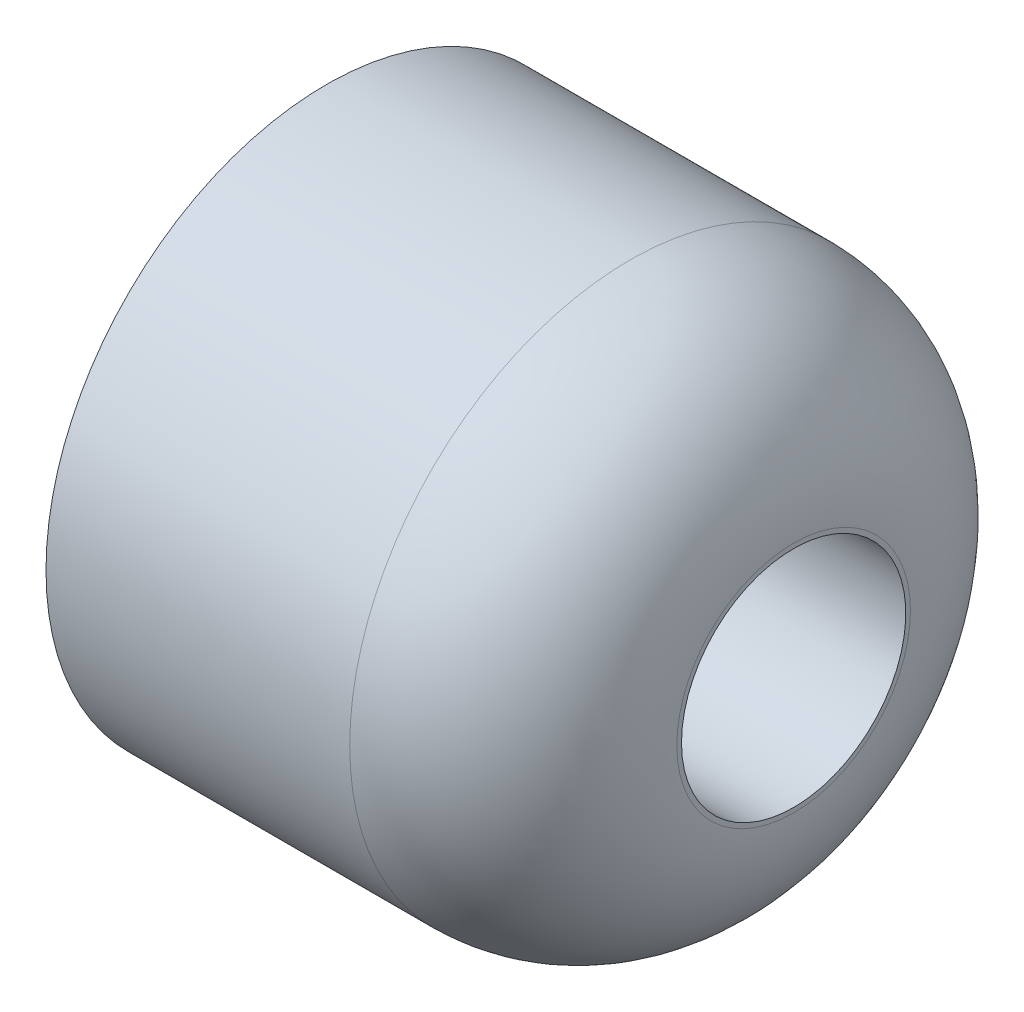
ISO-10303-21;
HEADER;
FILE_DESCRIPTION(('STEP AP214'),'2;1');
FILE_NAME('part.step','',(''),(''),'','','');
FILE_SCHEMA(('AUTOMOTIVE_DESIGN { 1 0 10303 214 1 1 1 1 }'));
ENDSEC;
DATA;
#1=APPLICATION_CONTEXT('core data for automotive mechanical design processes');
#2=APPLICATION_PROTOCOL_DEFINITION('international standard','automotive_design',2000,#1);
#3=PRODUCT_CONTEXT('',#1,'mechanical');
#4=PRODUCT('Part','Part','',(#3));
#5=PRODUCT_RELATED_PRODUCT_CATEGORY('part','',(#4));
#6=PRODUCT_DEFINITION_FORMATION('','',#4);
#7=PRODUCT_DEFINITION_CONTEXT('part definition',#1,'design');
#8=PRODUCT_DEFINITION('design','',#6,#7);
#9=PRODUCT_DEFINITION_SHAPE('','',#8);
#10=(LENGTH_UNIT() NAMED_UNIT(*) SI_UNIT(.MILLI.,.METRE.));
#11=(NAMED_UNIT(*) PLANE_ANGLE_UNIT() SI_UNIT($,.RADIAN.));
#12=(NAMED_UNIT(*) SI_UNIT($,.STERADIAN.) SOLID_ANGLE_UNIT());
#13=UNCERTAINTY_MEASURE_WITH_UNIT(LENGTH_MEASURE(1.E-05),#10,'distance_accuracy_value','');
#14=(GEOMETRIC_REPRESENTATION_CONTEXT(3) GLOBAL_UNCERTAINTY_ASSIGNED_CONTEXT((#13)) GLOBAL_UNIT_ASSIGNED_CONTEXT((#10,
#11,#12)) REPRESENTATION_CONTEXT('',''));
#15=CARTESIAN_POINT('',(0.,0.,0.));
#16=DIRECTION('',(0.,0.,1.));
#17=DIRECTION('',(1.,0.,0.));
#18=AXIS2_PLACEMENT_3D('',#15,#16,#17);
#19=CARTESIAN_POINT('',(6.5,0.,0.));
#20=DIRECTION('',(-1.,0.,0.));
#21=DIRECTION('',(0.,0.,1.));
#22=AXIS2_PLACEMENT_3D('',#19,#20,#21);
#23=DEGENERATE_TOROIDAL_SURFACE('',#22,2.5,3.5,.T.);
#24=CARTESIAN_POINT('',(10.,0.,0.));
#25=DIRECTION('',(-1.,0.,0.));
#26=DIRECTION('',(0.,0.,1.));
#27=AXIS2_PLACEMENT_3D('',#24,#25,#26);
#28=CIRCLE('',#27,2.49999999999998);
#29=CARTESIAN_POINT('',(10.,0.,2.49999999999998));
#30=VERTEX_POINT('',#29);
#31=EDGE_CURVE('E10',#30,#30,#28,.T.);
#32=ORIENTED_EDGE('',*,*,#31,.T.);
#33=EDGE_LOOP('',(#32));
#34=FACE_BOUND('',#33,.T.);
#35=CARTESIAN_POINT('',(6.49999999999998,0.,0.));
#36=DIRECTION('',(-1.,0.,0.));
#37=DIRECTION('',(0.,0.,1.));
#38=AXIS2_PLACEMENT_3D('',#35,#36,#37);
#39=CIRCLE('',#38,6.);
#40=CARTESIAN_POINT('',(6.49999999999998,0.,6.));
#41=VERTEX_POINT('',#40);
#42=EDGE_CURVE('E74',#41,#41,#39,.T.);
#43=ORIENTED_EDGE('',*,*,#42,.F.);
#44=EDGE_LOOP('',(#43));
#45=FACE_BOUND('',#44,.T.);
#46=ADVANCED_FACE('F43',(#34,#45),#23,.T.);
#47=CARTESIAN_POINT('',(10.,0.,2.4));
#48=DIRECTION('',(1.,0.,0.));
#49=DIRECTION('',(0.,0.,-1.));
#50=AXIS2_PLACEMENT_3D('',#47,#48,#49);
#51=PLANE('',#50);
#52=CARTESIAN_POINT('',(10.,0.,0.));
#53=DIRECTION('',(-1.,0.,0.));
#54=DIRECTION('',(0.,0.,1.));
#55=AXIS2_PLACEMENT_3D('',#52,#53,#54);
#56=CIRCLE('',#55,2.4);
#57=CARTESIAN_POINT('',(10.,0.,2.4));
#58=VERTEX_POINT('',#57);
#59=EDGE_CURVE('E49',#58,#58,#56,.T.);
#60=ORIENTED_EDGE('',*,*,#59,.T.);
#61=EDGE_LOOP('',(#60));
#62=FACE_BOUND('',#61,.T.);
#63=ORIENTED_EDGE('',*,*,#31,.F.);
#64=EDGE_LOOP('',(#63));
#65=FACE_BOUND('',#64,.T.);
#66=ADVANCED_FACE('F82',(#62,#65),#51,.T.);
#67=CARTESIAN_POINT('',(0.,0.,0.));
#68=DIRECTION('',(-1.,0.,0.));
#69=DIRECTION('',(0.,0.,1.));
#70=AXIS2_PLACEMENT_3D('',#67,#68,#69);
#71=CYLINDRICAL_SURFACE('',#70,2.4);
#72=CARTESIAN_POINT('',(0.,0.,0.));
#73=DIRECTION('',(-1.,0.,0.));
#74=DIRECTION('',(0.,0.,1.));
#75=AXIS2_PLACEMENT_3D('',#72,#73,#74);
#76=CIRCLE('',#75,2.4);
#77=CARTESIAN_POINT('',(0.,0.,2.4));
#78=VERTEX_POINT('',#77);
#79=EDGE_CURVE('E53',#78,#78,#76,.T.);
#80=ORIENTED_EDGE('',*,*,#79,.T.);
#81=EDGE_LOOP('',(#80));
#82=FACE_BOUND('',#81,.T.);
#83=ORIENTED_EDGE('',*,*,#59,.F.);
#84=EDGE_LOOP('',(#83));
#85=FACE_BOUND('',#84,.T.);
#86=ADVANCED_FACE('F87',(#82,#85),#71,.F.);
#87=CARTESIAN_POINT('',(0.,0.,2.4));
#88=DIRECTION('',(-1.,0.,0.));
#89=DIRECTION('',(0.,0.,1.));
#90=AXIS2_PLACEMENT_3D('',#87,#88,#89);
#91=PLANE('',#90);
#92=CARTESIAN_POINT('',(0.,0.,0.));
#93=DIRECTION('',(-1.,0.,0.));
#94=DIRECTION('',(0.,0.,1.));
#95=AXIS2_PLACEMENT_3D('',#92,#93,#94);
#96=CIRCLE('',#95,3.9);
#97=CARTESIAN_POINT('',(0.,0.,3.9));
#98=VERTEX_POINT('',#97);
#99=EDGE_CURVE('E57',#98,#98,#96,.T.);
#100=ORIENTED_EDGE('',*,*,#99,.T.);
#101=EDGE_LOOP('',(#100));
#102=FACE_BOUND('',#101,.T.);
#103=ORIENTED_EDGE('',*,*,#79,.F.);
#104=EDGE_LOOP('',(#103));
#105=FACE_BOUND('',#104,.T.);
#106=ADVANCED_FACE('F92',(#102,#105),#91,.T.);
#107=CARTESIAN_POINT('',(0.,0.,0.));
#108=DIRECTION('',(-1.,0.,0.));
#109=DIRECTION('',(0.,0.,1.));
#110=AXIS2_PLACEMENT_3D('',#107,#108,#109);
#111=CYLINDRICAL_SURFACE('',#110,3.9);
#112=CARTESIAN_POINT('',(6.,0.,0.));
#113=DIRECTION('',(-1.,0.,0.));
#114=DIRECTION('',(0.,0.,1.));
#115=AXIS2_PLACEMENT_3D('',#112,#113,#114);
#116=CIRCLE('',#115,3.9);
#117=CARTESIAN_POINT('',(6.,0.,3.9));
#118=VERTEX_POINT('',#117);
#119=EDGE_CURVE('E62',#118,#118,#116,.T.);
#120=ORIENTED_EDGE('',*,*,#119,.T.);
#121=EDGE_LOOP('',(#120));
#122=FACE_BOUND('',#121,.T.);
#123=ORIENTED_EDGE('',*,*,#99,.F.);
#124=EDGE_LOOP('',(#123));
#125=FACE_BOUND('',#124,.T.);
#126=ADVANCED_FACE('F99',(#122,#125),#111,.T.);
#127=CARTESIAN_POINT('',(6.,0.,3.9));
#128=DIRECTION('',(-1.,0.,0.));
#129=DIRECTION('',(0.,0.,1.));
#130=AXIS2_PLACEMENT_3D('',#127,#128,#129);
#131=PLANE('',#130);
#132=CARTESIAN_POINT('',(6.,0.,0.));
#133=DIRECTION('',(-1.,0.,0.));
#134=DIRECTION('',(0.,0.,1.));
#135=AXIS2_PLACEMENT_3D('',#132,#133,#134);
#136=CIRCLE('',#135,5.5);
#137=CARTESIAN_POINT('',(6.,0.,5.5));
#138=VERTEX_POINT('',#137);
#139=EDGE_CURVE('E65',#138,#138,#136,.T.);
#140=ORIENTED_EDGE('',*,*,#139,.T.);
#141=EDGE_LOOP('',(#140));
#142=FACE_BOUND('',#141,.T.);
#143=ORIENTED_EDGE('',*,*,#119,.F.);
#144=EDGE_LOOP('',(#143));
#145=FACE_BOUND('',#144,.T.);
#146=ADVANCED_FACE('F103',(#142,#145),#131,.T.);
#147=CARTESIAN_POINT('',(0.,0.,0.));
#148=DIRECTION('',(-1.,0.,0.));
#149=DIRECTION('',(0.,0.,1.));
#150=AXIS2_PLACEMENT_3D('',#147,#148,#149);
#151=CYLINDRICAL_SURFACE('',#150,5.5);
#152=CARTESIAN_POINT('',(0.,0.,0.));
#153=DIRECTION('',(-1.,0.,0.));
#154=DIRECTION('',(0.,0.,1.));
#155=AXIS2_PLACEMENT_3D('',#152,#153,#154);
#156=CIRCLE('',#155,5.5);
#157=CARTESIAN_POINT('',(0.,0.,5.5));
#158=VERTEX_POINT('',#157);
#159=EDGE_CURVE('E68',#158,#158,#156,.T.);
#160=ORIENTED_EDGE('',*,*,#159,.T.);
#161=EDGE_LOOP('',(#160));
#162=FACE_BOUND('',#161,.T.);
#163=ORIENTED_EDGE('',*,*,#139,.F.);
#164=EDGE_LOOP('',(#163));
#165=FACE_BOUND('',#164,.T.);
#166=ADVANCED_FACE('F107',(#162,#165),#151,.F.);
#167=CARTESIAN_POINT('',(0.,0.,5.5));
#168=DIRECTION('',(-1.,0.,0.));
#169=DIRECTION('',(0.,0.,1.));
#170=AXIS2_PLACEMENT_3D('',#167,#168,#169);
#171=PLANE('',#170);
#172=CARTESIAN_POINT('',(0.,0.,0.));
#173=DIRECTION('',(-1.,0.,0.));
#174=DIRECTION('',(0.,0.,1.));
#175=AXIS2_PLACEMENT_3D('',#172,#173,#174);
#176=CIRCLE('',#175,6.);
#177=CARTESIAN_POINT('',(0.,0.,6.));
#178=VERTEX_POINT('',#177);
#179=EDGE_CURVE('E71',#178,#178,#176,.T.);
#180=ORIENTED_EDGE('',*,*,#179,.T.);
#181=EDGE_LOOP('',(#180));
#182=FACE_BOUND('',#181,.T.);
#183=ORIENTED_EDGE('',*,*,#159,.F.);
#184=EDGE_LOOP('',(#183));
#185=FACE_BOUND('',#184,.T.);
#186=ADVANCED_FACE('F111',(#182,#185),#171,.T.);
#187=CARTESIAN_POINT('',(0.,0.,0.));
#188=DIRECTION('',(-1.,0.,0.));
#189=DIRECTION('',(0.,0.,1.));
#190=AXIS2_PLACEMENT_3D('',#187,#188,#189);
#191=CYLINDRICAL_SURFACE('',#190,6.);
#192=ORIENTED_EDGE('',*,*,#42,.T.);
#193=EDGE_LOOP('',(#192));
#194=FACE_BOUND('',#193,.T.);
#195=ORIENTED_EDGE('',*,*,#179,.F.);
#196=EDGE_LOOP('',(#195));
#197=FACE_BOUND('',#196,.T.);
#198=ADVANCED_FACE('F78',(#194,#197),#191,.T.);
#199=CLOSED_SHELL('',(#46,#66,#86,#106,#126,#146,#166,#186,#198));
#200=MANIFOLD_SOLID_BREP('B2',#199);
#201=ADVANCED_BREP_SHAPE_REPRESENTATION('',(#18,#200),#14);
#202=SHAPE_DEFINITION_REPRESENTATION(#9,#201);
ENDSEC;
END-ISO-10303-21;
